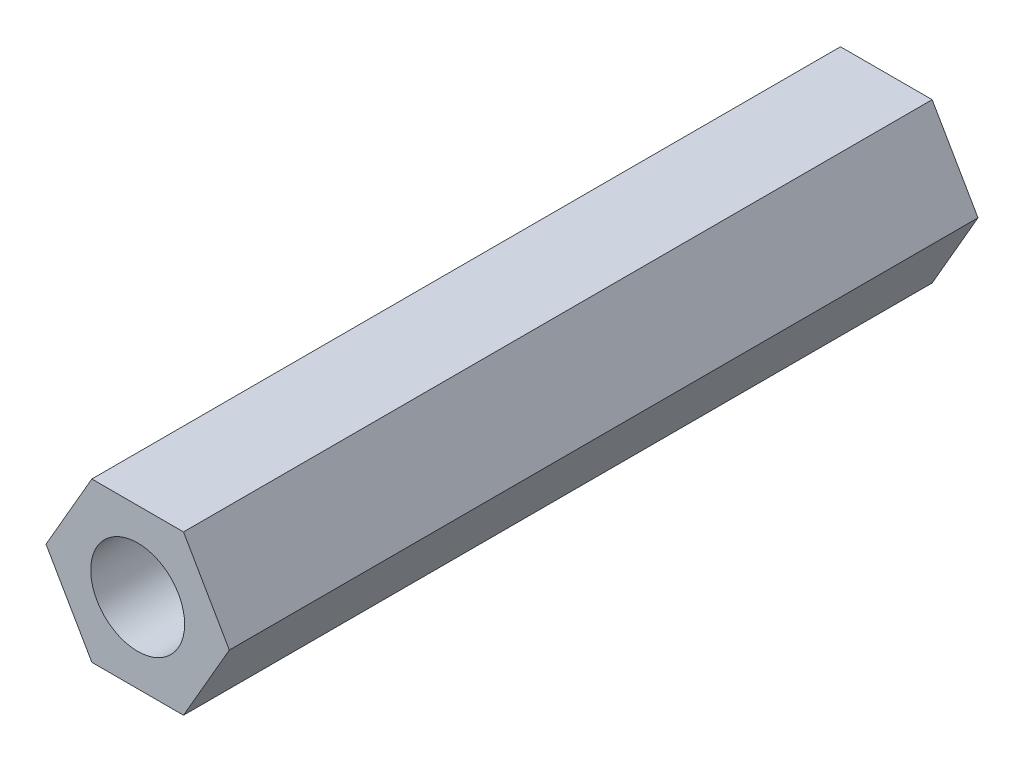
ISO-10303-21;
HEADER;
FILE_DESCRIPTION(('STEP AP214'),'2;1');
FILE_NAME('part.step','',(''),(''),'','','');
FILE_SCHEMA(('AUTOMOTIVE_DESIGN { 1 0 10303 214 1 1 1 1 }'));
ENDSEC;
DATA;
#1=APPLICATION_CONTEXT('core data for automotive mechanical design processes');
#2=APPLICATION_PROTOCOL_DEFINITION('international standard','automotive_design',2000,#1);
#3=PRODUCT_CONTEXT('',#1,'mechanical');
#4=PRODUCT('Part','Part','',(#3));
#5=PRODUCT_RELATED_PRODUCT_CATEGORY('part','',(#4));
#6=PRODUCT_DEFINITION_FORMATION('','',#4);
#7=PRODUCT_DEFINITION_CONTEXT('part definition',#1,'design');
#8=PRODUCT_DEFINITION('design','',#6,#7);
#9=PRODUCT_DEFINITION_SHAPE('','',#8);
#10=(LENGTH_UNIT() NAMED_UNIT(*) SI_UNIT(.MILLI.,.METRE.));
#11=(NAMED_UNIT(*) PLANE_ANGLE_UNIT() SI_UNIT($,.RADIAN.));
#12=(NAMED_UNIT(*) SI_UNIT($,.STERADIAN.) SOLID_ANGLE_UNIT());
#13=UNCERTAINTY_MEASURE_WITH_UNIT(LENGTH_MEASURE(1.E-05),#10,'distance_accuracy_value','');
#14=(GEOMETRIC_REPRESENTATION_CONTEXT(3) GLOBAL_UNCERTAINTY_ASSIGNED_CONTEXT((#13)) GLOBAL_UNIT_ASSIGNED_CONTEXT((#10,
#11,#12)) REPRESENTATION_CONTEXT('',''));
#15=CARTESIAN_POINT('',(0.,0.,0.));
#16=DIRECTION('',(0.,0.,1.));
#17=DIRECTION('',(1.,0.,0.));
#18=AXIS2_PLACEMENT_3D('',#15,#16,#17);
#19=CARTESIAN_POINT('',(0.,0.,22.2758));
#20=DIRECTION('',(0.,0.,1.));
#21=DIRECTION('',(1.,0.,0.));
#22=AXIS2_PLACEMENT_3D('',#19,#20,#21);
#23=PLANE('',#22);
#24=DIRECTION('',(-1.,0.,0.));
#25=VECTOR('',#24,1.);
#26=CARTESIAN_POINT('',(5.35048676212179,106.888971188357,22.2758));
#27=LINE('',#26,#25);
#28=CARTESIAN_POINT('',(5.35048676212179,106.888971188357,22.2758));
#29=VERTEX_POINT('',#28);
#30=CARTESIAN_POINT('',(2.62285315036235,106.888971188357,22.2758));
#31=VERTEX_POINT('',#30);
#32=EDGE_CURVE('E129',#29,#31,#27,.T.);
#33=ORIENTED_EDGE('',*,*,#32,.T.);
#34=DIRECTION('',(-0.5,-0.866025403784438,0.));
#35=VECTOR('',#34,1.);
#36=CARTESIAN_POINT('',(2.62285315036235,106.888971188357,22.2758));
#37=LINE('',#36,#35);
#38=CARTESIAN_POINT('',(1.25903634448259,104.526771188357,22.2758));
#39=VERTEX_POINT('',#38);
#40=EDGE_CURVE('E87',#31,#39,#37,.T.);
#41=ORIENTED_EDGE('',*,*,#40,.T.);
#42=DIRECTION('',(0.500000000000003,-0.866025403784437,0.));
#43=VECTOR('',#42,1.);
#44=CARTESIAN_POINT('',(1.25903634448259,104.526771188357,22.2758));
#45=LINE('',#44,#43);
#46=CARTESIAN_POINT('',(2.62285315036234,102.164571188357,22.2758));
#47=VERTEX_POINT('',#46);
#48=EDGE_CURVE('E100',#39,#47,#45,.T.);
#49=ORIENTED_EDGE('',*,*,#48,.T.);
#50=DIRECTION('',(1.,0.,0.));
#51=VECTOR('',#50,1.);
#52=CARTESIAN_POINT('',(2.62285315036234,102.164571188357,22.2758));
#53=LINE('',#52,#51);
#54=CARTESIAN_POINT('',(5.35048676212181,102.164571188357,22.2758));
#55=VERTEX_POINT('',#54);
#56=EDGE_CURVE('E94',#47,#55,#53,.T.);
#57=ORIENTED_EDGE('',*,*,#56,.T.);
#58=DIRECTION('',(0.500000000000001,0.866025403784438,0.));
#59=VECTOR('',#58,1.);
#60=CARTESIAN_POINT('',(5.35048676212181,102.164571188357,22.2758));
#61=LINE('',#60,#59);
#62=CARTESIAN_POINT('',(6.71430356800155,104.526771188357,22.2758));
#63=VERTEX_POINT('',#62);
#64=EDGE_CURVE('E98',#55,#63,#61,.T.);
#65=ORIENTED_EDGE('',*,*,#64,.T.);
#66=DIRECTION('',(-0.500000000000002,0.866025403784437,0.));
#67=VECTOR('',#66,1.);
#68=CARTESIAN_POINT('',(6.71430356800155,104.526771188357,22.2758));
#69=LINE('',#68,#67);
#70=EDGE_CURVE('E50',#63,#29,#69,.T.);
#71=ORIENTED_EDGE('',*,*,#70,.T.);
#72=EDGE_LOOP('',(#33,#41,#49,#57,#65,#71));
#73=FACE_BOUND('',#72,.T.);
#74=CARTESIAN_POINT('',(3.9866699562421,104.526771188357,22.2758));
#75=DIRECTION('',(0.,0.,1.));
#76=DIRECTION('',(1.,0.,0.));
#77=AXIS2_PLACEMENT_3D('',#74,#75,#76);
#78=CIRCLE('',#77,1.39700000000637);
#79=CARTESIAN_POINT('',(5.38366995624847,104.526771188357,22.2758));
#80=VERTEX_POINT('',#79);
#81=EDGE_CURVE('E122',#80,#80,#78,.T.);
#82=ORIENTED_EDGE('',*,*,#81,.F.);
#83=EDGE_LOOP('',(#82));
#84=FACE_BOUND('',#83,.T.);
#85=ADVANCED_FACE('F33',(#73,#84),#23,.T.);
#86=CARTESIAN_POINT('',(0.,0.,0.));
#87=DIRECTION('',(0.,0.,1.));
#88=DIRECTION('',(1.,0.,0.));
#89=AXIS2_PLACEMENT_3D('',#86,#87,#88);
#90=PLANE('',#89);
#91=DIRECTION('',(-1.,0.,0.));
#92=VECTOR('',#91,1.);
#93=CARTESIAN_POINT('',(5.35048676212179,106.888971188357,0.));
#94=LINE('',#93,#92);
#95=CARTESIAN_POINT('',(5.35048676212179,106.888971188357,0.));
#96=VERTEX_POINT('',#95);
#97=CARTESIAN_POINT('',(2.62285315036235,106.888971188357,0.));
#98=VERTEX_POINT('',#97);
#99=EDGE_CURVE('E118',#96,#98,#94,.T.);
#100=ORIENTED_EDGE('',*,*,#99,.F.);
#101=DIRECTION('',(-0.500000000000002,0.866025403784437,0.));
#102=VECTOR('',#101,1.);
#103=CARTESIAN_POINT('',(6.71430356800155,104.526771188357,0.));
#104=LINE('',#103,#102);
#105=CARTESIAN_POINT('',(6.71430356800155,104.526771188357,0.));
#106=VERTEX_POINT('',#105);
#107=EDGE_CURVE('E79',#106,#96,#104,.T.);
#108=ORIENTED_EDGE('',*,*,#107,.F.);
#109=DIRECTION('',(0.500000000000001,0.866025403784438,0.));
#110=VECTOR('',#109,1.);
#111=CARTESIAN_POINT('',(5.35048676212181,102.164571188357,0.));
#112=LINE('',#111,#110);
#113=CARTESIAN_POINT('',(5.35048676212181,102.164571188357,0.));
#114=VERTEX_POINT('',#113);
#115=EDGE_CURVE('E73',#114,#106,#112,.T.);
#116=ORIENTED_EDGE('',*,*,#115,.F.);
#117=DIRECTION('',(1.,0.,0.));
#118=VECTOR('',#117,1.);
#119=CARTESIAN_POINT('',(2.62285315036234,102.164571188357,0.));
#120=LINE('',#119,#118);
#121=CARTESIAN_POINT('',(2.62285315036234,102.164571188357,0.));
#122=VERTEX_POINT('',#121);
#123=EDGE_CURVE('E108',#122,#114,#120,.T.);
#124=ORIENTED_EDGE('',*,*,#123,.F.);
#125=DIRECTION('',(0.500000000000003,-0.866025403784437,0.));
#126=VECTOR('',#125,1.);
#127=CARTESIAN_POINT('',(1.25903634448259,104.526771188357,0.));
#128=LINE('',#127,#126);
#129=CARTESIAN_POINT('',(1.25903634448259,104.526771188357,0.));
#130=VERTEX_POINT('',#129);
#131=EDGE_CURVE('E124',#130,#122,#128,.T.);
#132=ORIENTED_EDGE('',*,*,#131,.F.);
#133=DIRECTION('',(-0.5,-0.866025403784438,0.));
#134=VECTOR('',#133,1.);
#135=CARTESIAN_POINT('',(2.62285315036235,106.888971188357,0.));
#136=LINE('',#135,#134);
#137=EDGE_CURVE('E121',#98,#130,#136,.T.);
#138=ORIENTED_EDGE('',*,*,#137,.F.);
#139=EDGE_LOOP('',(#100,#108,#116,#124,#132,#138));
#140=FACE_BOUND('',#139,.T.);
#141=CARTESIAN_POINT('',(3.9866699562421,104.526771188357,0.));
#142=DIRECTION('',(0.,0.,1.));
#143=DIRECTION('',(1.,0.,0.));
#144=AXIS2_PLACEMENT_3D('',#141,#142,#143);
#145=CIRCLE('',#144,1.39700000000637);
#146=CARTESIAN_POINT('',(5.38366995624847,104.526771188357,0.));
#147=VERTEX_POINT('',#146);
#148=EDGE_CURVE('E222',#147,#147,#145,.T.);
#149=ORIENTED_EDGE('',*,*,#148,.T.);
#150=EDGE_LOOP('',(#149));
#151=FACE_BOUND('',#150,.T.);
#152=ADVANCED_FACE('F138',(#140,#151),#90,.F.);
#153=CARTESIAN_POINT('',(5.35048676212179,106.888971188357,22.2758));
#154=DIRECTION('',(0.,-1.,0.));
#155=DIRECTION('',(0.,0.,-1.));
#156=AXIS2_PLACEMENT_3D('',#153,#154,#155);
#157=PLANE('',#156);
#158=ORIENTED_EDGE('',*,*,#99,.T.);
#159=DIRECTION('',(0.,0.,-1.));
#160=VECTOR('',#159,1.);
#161=CARTESIAN_POINT('',(2.62285315036235,106.888971188357,22.2758));
#162=LINE('',#161,#160);
#163=EDGE_CURVE('E11',#31,#98,#162,.T.);
#164=ORIENTED_EDGE('',*,*,#163,.F.);
#165=ORIENTED_EDGE('',*,*,#32,.F.);
#166=DIRECTION('',(0.,0.,-1.));
#167=VECTOR('',#166,1.);
#168=CARTESIAN_POINT('',(5.35048676212179,106.888971188357,22.2758));
#169=LINE('',#168,#167);
#170=EDGE_CURVE('E114',#29,#96,#169,.T.);
#171=ORIENTED_EDGE('',*,*,#170,.T.);
#172=EDGE_LOOP('',(#158,#164,#165,#171));
#173=FACE_BOUND('',#172,.T.);
#174=ADVANCED_FACE('F35',(#173),#157,.F.);
#175=CARTESIAN_POINT('',(2.62285315036235,106.888971188357,22.2758));
#176=DIRECTION('',(0.866025403784438,-0.5,0.));
#177=DIRECTION('',(0.5,0.866025403784439,0.));
#178=AXIS2_PLACEMENT_3D('',#175,#176,#177);
#179=PLANE('',#178);
#180=ORIENTED_EDGE('',*,*,#137,.T.);
#181=DIRECTION('',(0.,0.,-1.));
#182=VECTOR('',#181,1.);
#183=CARTESIAN_POINT('',(1.25903634448259,104.526771188357,22.2758));
#184=LINE('',#183,#182);
#185=EDGE_CURVE('E42',#39,#130,#184,.T.);
#186=ORIENTED_EDGE('',*,*,#185,.F.);
#187=ORIENTED_EDGE('',*,*,#40,.F.);
#188=ORIENTED_EDGE('',*,*,#163,.T.);
#189=EDGE_LOOP('',(#180,#186,#187,#188));
#190=FACE_BOUND('',#189,.T.);
#191=ADVANCED_FACE('F163',(#190),#179,.F.);
#192=CARTESIAN_POINT('',(1.25903634448259,104.526771188357,22.2758));
#193=DIRECTION('',(0.866025403784437,0.500000000000003,0.));
#194=DIRECTION('',(-0.500000000000003,0.866025403784437,0.));
#195=AXIS2_PLACEMENT_3D('',#192,#193,#194);
#196=PLANE('',#195);
#197=ORIENTED_EDGE('',*,*,#131,.T.);
#198=DIRECTION('',(0.,0.,-1.));
#199=VECTOR('',#198,1.);
#200=CARTESIAN_POINT('',(2.62285315036234,102.164571188357,22.2758));
#201=LINE('',#200,#199);
#202=EDGE_CURVE('E109',#47,#122,#201,.T.);
#203=ORIENTED_EDGE('',*,*,#202,.F.);
#204=ORIENTED_EDGE('',*,*,#48,.F.);
#205=ORIENTED_EDGE('',*,*,#185,.T.);
#206=EDGE_LOOP('',(#197,#203,#204,#205));
#207=FACE_BOUND('',#206,.T.);
#208=ADVANCED_FACE('F135',(#207),#196,.F.);
#209=CARTESIAN_POINT('',(2.62285315036234,102.164571188357,22.2758));
#210=DIRECTION('',(0.,1.,0.));
#211=DIRECTION('',(0.,0.,1.));
#212=AXIS2_PLACEMENT_3D('',#209,#210,#211);
#213=PLANE('',#212);
#214=ORIENTED_EDGE('',*,*,#123,.T.);
#215=DIRECTION('',(0.,0.,-1.));
#216=VECTOR('',#215,1.);
#217=CARTESIAN_POINT('',(5.35048676212181,102.164571188357,22.2758));
#218=LINE('',#217,#216);
#219=EDGE_CURVE('E105',#55,#114,#218,.T.);
#220=ORIENTED_EDGE('',*,*,#219,.F.);
#221=ORIENTED_EDGE('',*,*,#56,.F.);
#222=ORIENTED_EDGE('',*,*,#202,.T.);
#223=EDGE_LOOP('',(#214,#220,#221,#222));
#224=FACE_BOUND('',#223,.T.);
#225=ADVANCED_FACE('F106',(#224),#213,.F.);
#226=CARTESIAN_POINT('',(5.35048676212181,102.164571188357,22.2758));
#227=DIRECTION('',(-0.866025403784438,0.500000000000001,0.));
#228=DIRECTION('',(-0.500000000000001,-0.866025403784438,0.));
#229=AXIS2_PLACEMENT_3D('',#226,#227,#228);
#230=PLANE('',#229);
#231=ORIENTED_EDGE('',*,*,#115,.T.);
#232=DIRECTION('',(0.,0.,-1.));
#233=VECTOR('',#232,1.);
#234=CARTESIAN_POINT('',(6.71430356800155,104.526771188357,22.2758));
#235=LINE('',#234,#233);
#236=EDGE_CURVE('E110',#63,#106,#235,.T.);
#237=ORIENTED_EDGE('',*,*,#236,.F.);
#238=ORIENTED_EDGE('',*,*,#64,.F.);
#239=ORIENTED_EDGE('',*,*,#219,.T.);
#240=EDGE_LOOP('',(#231,#237,#238,#239));
#241=FACE_BOUND('',#240,.T.);
#242=ADVANCED_FACE('F112',(#241),#230,.F.);
#243=CARTESIAN_POINT('',(6.71430356800155,104.526771188357,22.2758));
#244=DIRECTION('',(-0.866025403784437,-0.500000000000002,0.));
#245=DIRECTION('',(0.500000000000002,-0.866025403784437,0.));
#246=AXIS2_PLACEMENT_3D('',#243,#244,#245);
#247=PLANE('',#246);
#248=ORIENTED_EDGE('',*,*,#107,.T.);
#249=ORIENTED_EDGE('',*,*,#170,.F.);
#250=ORIENTED_EDGE('',*,*,#70,.F.);
#251=ORIENTED_EDGE('',*,*,#236,.T.);
#252=EDGE_LOOP('',(#248,#249,#250,#251));
#253=FACE_BOUND('',#252,.T.);
#254=ADVANCED_FACE('F143',(#253),#247,.F.);
#255=CARTESIAN_POINT('',(3.9866699562421,104.526771188357,22.2758));
#256=DIRECTION('',(0.,0.,-1.));
#257=DIRECTION('',(-1.,0.,0.));
#258=AXIS2_PLACEMENT_3D('',#255,#256,#257);
#259=CYLINDRICAL_SURFACE('',#258,1.39700000000637);
#260=ORIENTED_EDGE('',*,*,#81,.T.);
#261=EDGE_LOOP('',(#260));
#262=FACE_BOUND('',#261,.T.);
#263=ORIENTED_EDGE('',*,*,#148,.F.);
#264=EDGE_LOOP('',(#263));
#265=FACE_BOUND('',#264,.T.);
#266=ADVANCED_FACE('F145',(#262,#265),#259,.F.);
#267=CLOSED_SHELL('',(#85,#152,#174,#191,#208,#225,#242,#254,#266));
#268=MANIFOLD_SOLID_BREP('B2',#267);
#269=ADVANCED_BREP_SHAPE_REPRESENTATION('',(#18,#268),#14);
#270=SHAPE_DEFINITION_REPRESENTATION(#9,#269);
ENDSEC;
END-ISO-10303-21;
